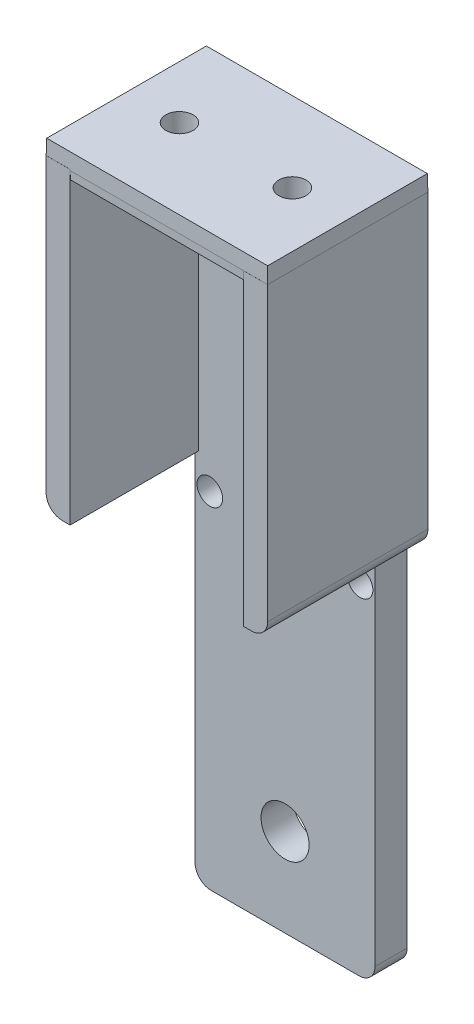
ISO-10303-21;
HEADER;
FILE_DESCRIPTION(('STEP AP214'),'2;1');
FILE_NAME('part.step','',(''),(''),'','','');
FILE_SCHEMA(('AUTOMOTIVE_DESIGN { 1 0 10303 214 1 1 1 1 }'));
ENDSEC;
DATA;
#1=APPLICATION_CONTEXT('core data for automotive mechanical design processes');
#2=APPLICATION_PROTOCOL_DEFINITION('international standard','automotive_design',2000,#1);
#3=PRODUCT_CONTEXT('',#1,'mechanical');
#4=PRODUCT('Part','Part','',(#3));
#5=PRODUCT_RELATED_PRODUCT_CATEGORY('part','',(#4));
#6=PRODUCT_DEFINITION_FORMATION('','',#4);
#7=PRODUCT_DEFINITION_CONTEXT('part definition',#1,'design');
#8=PRODUCT_DEFINITION('design','',#6,#7);
#9=PRODUCT_DEFINITION_SHAPE('','',#8);
#10=(LENGTH_UNIT() NAMED_UNIT(*) SI_UNIT(.MILLI.,.METRE.));
#11=(NAMED_UNIT(*) PLANE_ANGLE_UNIT() SI_UNIT($,.RADIAN.));
#12=(NAMED_UNIT(*) SI_UNIT($,.STERADIAN.) SOLID_ANGLE_UNIT());
#13=UNCERTAINTY_MEASURE_WITH_UNIT(LENGTH_MEASURE(1.E-05),#10,'distance_accuracy_value','');
#14=(GEOMETRIC_REPRESENTATION_CONTEXT(3) GLOBAL_UNCERTAINTY_ASSIGNED_CONTEXT((#13)) GLOBAL_UNIT_ASSIGNED_CONTEXT((#10,
#11,#12)) REPRESENTATION_CONTEXT('',''));
#15=CARTESIAN_POINT('',(0.,0.,0.));
#16=DIRECTION('',(0.,0.,1.));
#17=DIRECTION('',(1.,0.,0.));
#18=AXIS2_PLACEMENT_3D('',#15,#16,#17);
#19=CARTESIAN_POINT('',(-11.225,42.5,4.));
#20=DIRECTION('',(0.,1.,0.));
#21=DIRECTION('',(0.,0.,1.));
#22=AXIS2_PLACEMENT_3D('',#19,#20,#21);
#23=PLANE('',#22);
#24=DIRECTION('',(0.,0.,-1.));
#25=VECTOR('',#24,1.);
#26=CARTESIAN_POINT('',(13.8256157059448,42.5,20.));
#27=LINE('',#26,#25);
#28=CARTESIAN_POINT('',(13.8256157059448,42.5,20.));
#29=VERTEX_POINT('',#28);
#30=CARTESIAN_POINT('',(13.8256157059448,42.5,19.9955107536195));
#31=VERTEX_POINT('',#30);
#32=EDGE_CURVE('E301',#29,#31,#27,.T.);
#33=ORIENTED_EDGE('',*,*,#32,.T.);
#34=DIRECTION('',(1.,0.,0.));
#35=VECTOR('',#34,1.);
#36=CARTESIAN_POINT('',(13.8256157059448,42.5,19.9955107536195));
#37=LINE('',#36,#35);
#38=CARTESIAN_POINT('',(10.8256157059448,42.5,19.9955107536195));
#39=VERTEX_POINT('',#38);
#40=EDGE_CURVE('E217',#39,#31,#37,.T.);
#41=ORIENTED_EDGE('',*,*,#40,.F.);
#42=DIRECTION('',(0.,0.,-1.));
#43=VECTOR('',#42,1.);
#44=CARTESIAN_POINT('',(10.8256157059448,42.5,20.));
#45=LINE('',#44,#43);
#46=CARTESIAN_POINT('',(10.8256157059448,42.5,20.));
#47=VERTEX_POINT('',#46);
#48=EDGE_CURVE('E296',#47,#39,#45,.T.);
#49=ORIENTED_EDGE('',*,*,#48,.F.);
#50=DIRECTION('',(-1.,0.,0.));
#51=VECTOR('',#50,1.);
#52=CARTESIAN_POINT('',(10.8256157059448,42.5,20.));
#53=LINE('',#52,#51);
#54=EDGE_CURVE('E294',#29,#47,#53,.T.);
#55=ORIENTED_EDGE('',*,*,#54,.F.);
#56=EDGE_LOOP('',(#33,#41,#49,#55));
#57=FACE_BOUND('',#56,.T.);
#58=ADVANCED_FACE('F32',(#57),#23,.T.);
#59=CARTESIAN_POINT('',(-10.8172628171987,42.6265745661962,20.));
#60=DIRECTION('',(-1.,0.,0.));
#61=DIRECTION('',(0.,-1.,0.));
#62=AXIS2_PLACEMENT_3D('',#59,#60,#61);
#63=PLANE('',#62);
#64=DIRECTION('',(0.,-0.999847695156391,-0.0174524064372835));
#65=VECTOR('',#64,1.);
#66=CARTESIAN_POINT('',(-10.8172628171987,42.9755309803184,0.00830042413683257));
#67=LINE('',#66,#65);
#68=CARTESIAN_POINT('',(-10.8172628171987,42.5,0.));
#69=VERTEX_POINT('',#68);
#70=CARTESIAN_POINT('',(-10.8172628171987,42.6265745661962,0.00220936727121299));
#71=VERTEX_POINT('',#70);
#72=EDGE_CURVE('E239',#69,#71,#67,.F.);
#73=ORIENTED_EDGE('',*,*,#72,.F.);
#74=DIRECTION('',(0.,1.,0.));
#75=VECTOR('',#74,1.);
#76=CARTESIAN_POINT('',(-10.8172628171987,42.6265745661962,0.));
#77=LINE('',#76,#75);
#78=CARTESIAN_POINT('',(-10.8172628171987,42.6265745661962,0.));
#79=VERTEX_POINT('',#78);
#80=EDGE_CURVE('E263',#69,#79,#77,.T.);
#81=ORIENTED_EDGE('',*,*,#80,.T.);
#82=DIRECTION('',(0.,0.,-1.));
#83=VECTOR('',#82,1.);
#84=CARTESIAN_POINT('',(-10.8172628171987,42.6265745661962,20.));
#85=LINE('',#84,#83);
#86=EDGE_CURVE('E269',#71,#79,#85,.T.);
#87=ORIENTED_EDGE('',*,*,#86,.F.);
#88=EDGE_LOOP('',(#73,#81,#87));
#89=FACE_BOUND('',#88,.T.);
#90=ADVANCED_FACE('F422',(#89),#63,.F.);
#91=CARTESIAN_POINT('',(-13.8172628171987,42.6265745661962,20.));
#92=DIRECTION('',(0.,-1.,0.));
#93=DIRECTION('',(0.,0.,-1.));
#94=AXIS2_PLACEMENT_3D('',#91,#92,#93);
#95=PLANE('',#94);
#96=DIRECTION('',(1.,0.,0.));
#97=VECTOR('',#96,1.);
#98=CARTESIAN_POINT('',(-13.8172628171987,42.6265745661962,0.00220936727121299));
#99=LINE('',#98,#97);
#100=CARTESIAN_POINT('',(-13.8150534499275,42.6265745661962,0.0022093672712164));
#101=VERTEX_POINT('',#100);
#102=EDGE_CURVE('E41',#71,#101,#99,.F.);
#103=ORIENTED_EDGE('',*,*,#102,.F.);
#104=ORIENTED_EDGE('',*,*,#86,.T.);
#105=DIRECTION('',(-1.,0.,0.));
#106=VECTOR('',#105,1.);
#107=CARTESIAN_POINT('',(-13.8172628171987,42.6265745661962,0.));
#108=LINE('',#107,#106);
#109=CARTESIAN_POINT('',(-13.8172628171987,42.6265745661962,0.));
#110=VERTEX_POINT('',#109);
#111=EDGE_CURVE('E253',#79,#110,#108,.T.);
#112=ORIENTED_EDGE('',*,*,#111,.T.);
#113=DIRECTION('',(0.,0.,-1.));
#114=VECTOR('',#113,1.);
#115=CARTESIAN_POINT('',(-13.8172628171987,42.6265745661962,20.));
#116=LINE('',#115,#114);
#117=CARTESIAN_POINT('',(-13.8172628171987,42.6265745661962,20.));
#118=VERTEX_POINT('',#117);
#119=EDGE_CURVE('E259',#118,#110,#116,.T.);
#120=ORIENTED_EDGE('',*,*,#119,.F.);
#121=DIRECTION('',(-1.,0.,0.));
#122=VECTOR('',#121,1.);
#123=CARTESIAN_POINT('',(-13.8172628171987,42.6265745661962,20.));
#124=LINE('',#123,#122);
#125=CARTESIAN_POINT('',(-10.8172628171987,42.6265745661962,20.));
#126=VERTEX_POINT('',#125);
#127=EDGE_CURVE('E257',#126,#118,#124,.T.);
#128=ORIENTED_EDGE('',*,*,#127,.F.);
#129=CARTESIAN_POINT('',(-10.8172628171987,42.6265745661962,19.9933013863483));
#130=VERTEX_POINT('',#129);
#131=EDGE_CURVE('E270',#126,#130,#85,.T.);
#132=ORIENTED_EDGE('',*,*,#131,.T.);
#133=DIRECTION('',(-1.,0.,0.));
#134=VECTOR('',#133,1.);
#135=CARTESIAN_POINT('',(-13.8172628171987,42.6265745661962,19.9933013863483));
#136=LINE('',#135,#134);
#137=CARTESIAN_POINT('',(-13.8150534499275,42.6265745661962,19.9933013863483));
#138=VERTEX_POINT('',#137);
#139=EDGE_CURVE('E390',#138,#130,#136,.F.);
#140=ORIENTED_EDGE('',*,*,#139,.F.);
#141=DIRECTION('',(0.,0.,-1.));
#142=VECTOR('',#141,1.);
#143=CARTESIAN_POINT('',(-13.8150534499275,42.6265745661962,20.));
#144=LINE('',#143,#142);
#145=EDGE_CURVE('E393',#101,#138,#144,.F.);
#146=ORIENTED_EDGE('',*,*,#145,.F.);
#147=EDGE_LOOP('',(#103,#104,#112,#120,#128,#132,#140,#146));
#148=FACE_BOUND('',#147,.T.);
#149=ADVANCED_FACE('F429',(#148),#95,.F.);
#150=CARTESIAN_POINT('',(0.,0.,4.));
#151=DIRECTION('',(0.,0.,-1.));
#152=DIRECTION('',(-1.,0.,0.));
#153=AXIS2_PLACEMENT_3D('',#150,#151,#152);
#154=PLANE('',#153);
#155=CARTESIAN_POINT('',(-9.39147478922262,0.549780329016245,4.));
#156=DIRECTION('',(0.,0.,1.));
#157=DIRECTION('',(1.,0.,0.));
#158=AXIS2_PLACEMENT_3D('',#155,#156,#157);
#159=CIRCLE('',#158,1.6);
#160=CARTESIAN_POINT('',(-7.79147478922262,0.549780329016245,4.));
#161=VERTEX_POINT('',#160);
#162=EDGE_CURVE('E315',#161,#161,#159,.T.);
#163=ORIENTED_EDGE('',*,*,#162,.F.);
#164=EDGE_LOOP('',(#163));
#165=FACE_BOUND('',#164,.T.);
#166=CARTESIAN_POINT('',(9.35940364880709,0.0497499299107451,4.));
#167=DIRECTION('',(0.,0.,1.));
#168=DIRECTION('',(1.,0.,0.));
#169=AXIS2_PLACEMENT_3D('',#166,#167,#168);
#170=CIRCLE('',#169,1.6);
#171=CARTESIAN_POINT('',(10.9594036488071,0.0497499299107451,4.));
#172=VERTEX_POINT('',#171);
#173=EDGE_CURVE('E322',#172,#172,#170,.T.);
#174=ORIENTED_EDGE('',*,*,#173,.F.);
#175=EDGE_LOOP('',(#174));
#176=FACE_BOUND('',#175,.T.);
#177=CARTESIAN_POINT('',(0.,-31.5,4.));
#178=DIRECTION('',(0.,0.,1.));
#179=DIRECTION('',(1.,0.,0.));
#180=AXIS2_PLACEMENT_3D('',#177,#178,#179);
#181=CIRCLE('',#180,3.);
#182=CARTESIAN_POINT('',(3.,-31.5,4.));
#183=VERTEX_POINT('',#182);
#184=EDGE_CURVE('E327',#183,#183,#181,.T.);
#185=ORIENTED_EDGE('',*,*,#184,.F.);
#186=EDGE_LOOP('',(#185));
#187=FACE_BOUND('',#186,.T.);
#188=DIRECTION('',(0.,-1.,0.));
#189=VECTOR('',#188,1.);
#190=CARTESIAN_POINT('',(10.8256157059448,0.,4.));
#191=LINE('',#190,#189);
#192=CARTESIAN_POINT('',(10.8256157059448,41.5,4.));
#193=VERTEX_POINT('',#192);
#194=CARTESIAN_POINT('',(10.8256157059448,4.06249585883763,4.));
#195=VERTEX_POINT('',#194);
#196=EDGE_CURVE('E312',#193,#195,#191,.T.);
#197=ORIENTED_EDGE('',*,*,#196,.F.);
#198=DIRECTION('',(-1.,0.,0.));
#199=VECTOR('',#198,1.);
#200=CARTESIAN_POINT('',(0.,41.5,4.));
#201=LINE('',#200,#199);
#202=CARTESIAN_POINT('',(-10.8172628171987,41.5,4.));
#203=VERTEX_POINT('',#202);
#204=EDGE_CURVE('E245',#193,#203,#201,.T.);
#205=ORIENTED_EDGE('',*,*,#204,.T.);
#206=DIRECTION('',(0.,1.,0.));
#207=VECTOR('',#206,1.);
#208=CARTESIAN_POINT('',(-10.8172628171987,0.,4.));
#209=LINE('',#208,#207);
#210=CARTESIAN_POINT('',(-10.8172628171987,4.18907042503389,4.));
#211=VERTEX_POINT('',#210);
#212=EDGE_CURVE('E275',#211,#203,#209,.T.);
#213=ORIENTED_EDGE('',*,*,#212,.F.);
#214=DIRECTION('',(1.,0.,0.));
#215=VECTOR('',#214,1.);
#216=CARTESIAN_POINT('',(0.,4.18907042503389,4.));
#217=LINE('',#216,#215);
#218=CARTESIAN_POINT('',(-11.225,4.18907042503389,4.));
#219=VERTEX_POINT('',#218);
#220=EDGE_CURVE('E281',#219,#211,#217,.T.);
#221=ORIENTED_EDGE('',*,*,#220,.F.);
#222=DIRECTION('',(0.,-1.,0.));
#223=VECTOR('',#222,1.);
#224=CARTESIAN_POINT('',(-11.225,42.5,4.));
#225=LINE('',#224,#223);
#226=CARTESIAN_POINT('',(-11.225,-40.5,4.));
#227=VERTEX_POINT('',#226);
#228=EDGE_CURVE('E340',#219,#227,#225,.T.);
#229=ORIENTED_EDGE('',*,*,#228,.T.);
#230=CARTESIAN_POINT('',(-9.225,-40.5,4.));
#231=DIRECTION('',(0.,0.,-1.));
#232=DIRECTION('',(-1.,0.,0.));
#233=AXIS2_PLACEMENT_3D('',#230,#231,#232);
#234=CIRCLE('',#233,2.);
#235=CARTESIAN_POINT('',(-9.225,-42.5,4.));
#236=VERTEX_POINT('',#235);
#237=EDGE_CURVE('E384',#227,#236,#234,.F.);
#238=ORIENTED_EDGE('',*,*,#237,.T.);
#239=DIRECTION('',(1.,0.,0.));
#240=VECTOR('',#239,1.);
#241=CARTESIAN_POINT('',(-11.225,-42.5,4.));
#242=LINE('',#241,#240);
#243=CARTESIAN_POINT('',(9.225,-42.5,4.));
#244=VERTEX_POINT('',#243);
#245=EDGE_CURVE('E333',#236,#244,#242,.T.);
#246=ORIENTED_EDGE('',*,*,#245,.T.);
#247=CARTESIAN_POINT('',(9.225,-40.5,4.));
#248=DIRECTION('',(0.,0.,-1.));
#249=DIRECTION('',(-1.,0.,0.));
#250=AXIS2_PLACEMENT_3D('',#247,#248,#249);
#251=CIRCLE('',#250,2.);
#252=CARTESIAN_POINT('',(11.225,-40.5,4.));
#253=VERTEX_POINT('',#252);
#254=EDGE_CURVE('E386',#244,#253,#251,.F.);
#255=ORIENTED_EDGE('',*,*,#254,.T.);
#256=DIRECTION('',(0.,-1.,0.));
#257=VECTOR('',#256,1.);
#258=CARTESIAN_POINT('',(11.225,42.5,4.));
#259=LINE('',#258,#257);
#260=CARTESIAN_POINT('',(11.225,4.06249585883763,4.));
#261=VERTEX_POINT('',#260);
#262=EDGE_CURVE('E336',#261,#253,#259,.T.);
#263=ORIENTED_EDGE('',*,*,#262,.F.);
#264=DIRECTION('',(1.,0.,0.));
#265=VECTOR('',#264,1.);
#266=CARTESIAN_POINT('',(0.,4.06249585883763,4.));
#267=LINE('',#266,#265);
#268=EDGE_CURVE('E307',#195,#261,#267,.T.);
#269=ORIENTED_EDGE('',*,*,#268,.F.);
#270=EDGE_LOOP('',(#197,#205,#213,#221,#229,#238,#246,#255,#263,#269));
#271=FACE_BOUND('',#270,.T.);
#272=ADVANCED_FACE('F466',(#165,#176,#187,#271),#154,.F.);
#273=CARTESIAN_POINT('',(-11.225,42.5,4.));
#274=DIRECTION('',(1.,0.,0.));
#275=DIRECTION('',(0.,1.,0.));
#276=AXIS2_PLACEMENT_3D('',#273,#274,#275);
#277=PLANE('',#276);
#278=DIRECTION('',(0.,-1.,0.));
#279=VECTOR('',#278,1.);
#280=CARTESIAN_POINT('',(-11.225,42.5,0.));
#281=LINE('',#280,#279);
#282=CARTESIAN_POINT('',(-11.225,4.18907042503389,0.));
#283=VERTEX_POINT('',#282);
#284=CARTESIAN_POINT('',(-11.225,-40.5,0.));
#285=VERTEX_POINT('',#284);
#286=EDGE_CURVE('E337',#283,#285,#281,.T.);
#287=ORIENTED_EDGE('',*,*,#286,.T.);
#288=DIRECTION('',(0.,0.,-1.));
#289=VECTOR('',#288,1.);
#290=CARTESIAN_POINT('',(-11.225,-40.5,4.));
#291=LINE('',#290,#289);
#292=EDGE_CURVE('E388',#285,#227,#291,.F.);
#293=ORIENTED_EDGE('',*,*,#292,.T.);
#294=ORIENTED_EDGE('',*,*,#228,.F.);
#295=DIRECTION('',(0.,0.,1.));
#296=VECTOR('',#295,1.);
#297=CARTESIAN_POINT('',(-11.225,4.18907042503389,4.));
#298=LINE('',#297,#296);
#299=EDGE_CURVE('E278',#283,#219,#298,.T.);
#300=ORIENTED_EDGE('',*,*,#299,.F.);
#301=EDGE_LOOP('',(#287,#293,#294,#300));
#302=FACE_BOUND('',#301,.T.);
#303=ADVANCED_FACE('F435',(#302),#277,.F.);
#304=CARTESIAN_POINT('',(11.225,42.5,4.));
#305=DIRECTION('',(1.,0.,0.));
#306=DIRECTION('',(0.,1.,0.));
#307=AXIS2_PLACEMENT_3D('',#304,#305,#306);
#308=PLANE('',#307);
#309=ORIENTED_EDGE('',*,*,#262,.T.);
#310=DIRECTION('',(0.,0.,-1.));
#311=VECTOR('',#310,1.);
#312=CARTESIAN_POINT('',(11.225,-40.5,0.));
#313=LINE('',#312,#311);
#314=CARTESIAN_POINT('',(11.225,-40.5,0.));
#315=VERTEX_POINT('',#314);
#316=EDGE_CURVE('E376',#253,#315,#313,.T.);
#317=ORIENTED_EDGE('',*,*,#316,.T.);
#318=DIRECTION('',(0.,-1.,0.));
#319=VECTOR('',#318,1.);
#320=CARTESIAN_POINT('',(11.225,42.5,0.));
#321=LINE('',#320,#319);
#322=CARTESIAN_POINT('',(11.225,4.06249585883763,0.));
#323=VERTEX_POINT('',#322);
#324=EDGE_CURVE('E346',#323,#315,#321,.T.);
#325=ORIENTED_EDGE('',*,*,#324,.F.);
#326=DIRECTION('',(0.,0.,1.));
#327=VECTOR('',#326,1.);
#328=CARTESIAN_POINT('',(11.225,4.06249585883763,4.));
#329=LINE('',#328,#327);
#330=EDGE_CURVE('E309',#323,#261,#329,.T.);
#331=ORIENTED_EDGE('',*,*,#330,.T.);
#332=EDGE_LOOP('',(#309,#317,#325,#331));
#333=FACE_BOUND('',#332,.T.);
#334=ADVANCED_FACE('F437',(#333),#308,.T.);
#335=CARTESIAN_POINT('',(-11.225,-42.5,4.));
#336=DIRECTION('',(0.,1.,0.));
#337=DIRECTION('',(0.,0.,1.));
#338=AXIS2_PLACEMENT_3D('',#335,#336,#337);
#339=PLANE('',#338);
#340=DIRECTION('',(1.,0.,0.));
#341=VECTOR('',#340,1.);
#342=CARTESIAN_POINT('',(-11.225,-42.5,0.));
#343=LINE('',#342,#341);
#344=CARTESIAN_POINT('',(-9.225,-42.5,0.));
#345=VERTEX_POINT('',#344);
#346=CARTESIAN_POINT('',(9.225,-42.5,0.));
#347=VERTEX_POINT('',#346);
#348=EDGE_CURVE('E330',#345,#347,#343,.T.);
#349=ORIENTED_EDGE('',*,*,#348,.T.);
#350=DIRECTION('',(0.,0.,-1.));
#351=VECTOR('',#350,1.);
#352=CARTESIAN_POINT('',(9.225,-42.5,4.));
#353=LINE('',#352,#351);
#354=EDGE_CURVE('E382',#347,#244,#353,.F.);
#355=ORIENTED_EDGE('',*,*,#354,.T.);
#356=ORIENTED_EDGE('',*,*,#245,.F.);
#357=DIRECTION('',(0.,0.,-1.));
#358=VECTOR('',#357,1.);
#359=CARTESIAN_POINT('',(-9.225,-42.5,4.));
#360=LINE('',#359,#358);
#361=EDGE_CURVE('E379',#236,#345,#360,.T.);
#362=ORIENTED_EDGE('',*,*,#361,.T.);
#363=EDGE_LOOP('',(#349,#355,#356,#362));
#364=FACE_BOUND('',#363,.T.);
#365=ADVANCED_FACE('F440',(#364),#339,.F.);
#366=CARTESIAN_POINT('',(0.,0.,0.));
#367=DIRECTION('',(0.,0.,-1.));
#368=DIRECTION('',(-1.,0.,0.));
#369=AXIS2_PLACEMENT_3D('',#366,#367,#368);
#370=PLANE('',#369);
#371=CARTESIAN_POINT('',(-11.8172628171987,6.18907042503389,0.));
#372=DIRECTION('',(0.,0.,-1.));
#373=DIRECTION('',(-1.,0.,0.));
#374=AXIS2_PLACEMENT_3D('',#371,#372,#373);
#375=CIRCLE('',#374,2.);
#376=CARTESIAN_POINT('',(-11.8172628171987,4.18907042503389,0.));
#377=VERTEX_POINT('',#376);
#378=CARTESIAN_POINT('',(-13.8172628171987,6.18907042503389,0.));
#379=VERTEX_POINT('',#378);
#380=EDGE_CURVE('E360',#377,#379,#375,.T.);
#381=ORIENTED_EDGE('',*,*,#380,.T.);
#382=DIRECTION('',(0.,-1.,0.));
#383=VECTOR('',#382,1.);
#384=CARTESIAN_POINT('',(-13.8172628171987,42.6265745661962,0.));
#385=LINE('',#384,#383);
#386=EDGE_CURVE('E248',#110,#379,#385,.T.);
#387=ORIENTED_EDGE('',*,*,#386,.F.);
#388=ORIENTED_EDGE('',*,*,#111,.F.);
#389=ORIENTED_EDGE('',*,*,#80,.F.);
#390=DIRECTION('',(1.,0.,0.));
#391=VECTOR('',#390,1.);
#392=CARTESIAN_POINT('',(-11.225,42.5,0.));
#393=LINE('',#392,#391);
#394=CARTESIAN_POINT('',(13.8256157059448,42.5,0.));
#395=VERTEX_POINT('',#394);
#396=EDGE_CURVE('E349',#69,#395,#393,.T.);
#397=ORIENTED_EDGE('',*,*,#396,.T.);
#398=DIRECTION('',(0.,1.,0.));
#399=VECTOR('',#398,1.);
#400=CARTESIAN_POINT('',(13.8256157059448,42.5,0.));
#401=LINE('',#400,#399);
#402=CARTESIAN_POINT('',(13.8256157059448,6.06249585883763,0.));
#403=VERTEX_POINT('',#402);
#404=EDGE_CURVE('E289',#403,#395,#401,.T.);
#405=ORIENTED_EDGE('',*,*,#404,.F.);
#406=CARTESIAN_POINT('',(11.8256157059448,6.06249585883763,0.));
#407=DIRECTION('',(0.,0.,-1.));
#408=DIRECTION('',(-1.,0.,0.));
#409=AXIS2_PLACEMENT_3D('',#406,#407,#408);
#410=CIRCLE('',#409,2.);
#411=CARTESIAN_POINT('',(11.8256157059448,4.06249585883763,0.));
#412=VERTEX_POINT('',#411);
#413=EDGE_CURVE('E363',#403,#412,#410,.T.);
#414=ORIENTED_EDGE('',*,*,#413,.T.);
#415=DIRECTION('',(1.,0.,0.));
#416=VECTOR('',#415,1.);
#417=CARTESIAN_POINT('',(10.8256157059448,4.06249585883763,0.));
#418=LINE('',#417,#416);
#419=EDGE_CURVE('E284',#323,#412,#418,.T.);
#420=ORIENTED_EDGE('',*,*,#419,.F.);
#421=ORIENTED_EDGE('',*,*,#324,.T.);
#422=CARTESIAN_POINT('',(9.225,-40.5,0.));
#423=DIRECTION('',(0.,0.,-1.));
#424=DIRECTION('',(-1.,0.,0.));
#425=AXIS2_PLACEMENT_3D('',#422,#423,#424);
#426=CIRCLE('',#425,2.);
#427=EDGE_CURVE('E358',#315,#347,#426,.T.);
#428=ORIENTED_EDGE('',*,*,#427,.T.);
#429=ORIENTED_EDGE('',*,*,#348,.F.);
#430=CARTESIAN_POINT('',(-9.225,-40.5,0.));
#431=DIRECTION('',(0.,0.,-1.));
#432=DIRECTION('',(-1.,0.,0.));
#433=AXIS2_PLACEMENT_3D('',#430,#431,#432);
#434=CIRCLE('',#433,2.);
#435=EDGE_CURVE('E356',#345,#285,#434,.T.);
#436=ORIENTED_EDGE('',*,*,#435,.T.);
#437=ORIENTED_EDGE('',*,*,#286,.F.);
#438=DIRECTION('',(1.,0.,0.));
#439=VECTOR('',#438,1.);
#440=CARTESIAN_POINT('',(-13.8172628171987,4.18907042503389,0.));
#441=LINE('',#440,#439);
#442=EDGE_CURVE('E261',#377,#283,#441,.T.);
#443=ORIENTED_EDGE('',*,*,#442,.F.);
#444=EDGE_LOOP('',(#381,#387,#388,#389,#397,#405,#414,#420,#421,#428,#429,#436,#437,#443));
#445=FACE_BOUND('',#444,.T.);
#446=CARTESIAN_POINT('',(-9.39147478922262,0.549780329016245,0.));
#447=DIRECTION('',(0.,0.,1.));
#448=DIRECTION('',(1.,0.,0.));
#449=AXIS2_PLACEMENT_3D('',#446,#447,#448);
#450=CIRCLE('',#449,1.6);
#451=CARTESIAN_POINT('',(-7.79147478922262,0.549780329016245,0.));
#452=VERTEX_POINT('',#451);
#453=EDGE_CURVE('E319',#452,#452,#450,.T.);
#454=ORIENTED_EDGE('',*,*,#453,.T.);
#455=EDGE_LOOP('',(#454));
#456=FACE_BOUND('',#455,.T.);
#457=CARTESIAN_POINT('',(9.35940364880709,0.0497499299107451,0.));
#458=DIRECTION('',(0.,0.,1.));
#459=DIRECTION('',(1.,0.,0.));
#460=AXIS2_PLACEMENT_3D('',#457,#458,#459);
#461=CIRCLE('',#460,1.6);
#462=CARTESIAN_POINT('',(10.9594036488071,0.0497499299107451,0.));
#463=VERTEX_POINT('',#462);
#464=EDGE_CURVE('E314',#463,#463,#461,.T.);
#465=ORIENTED_EDGE('',*,*,#464,.T.);
#466=EDGE_LOOP('',(#465));
#467=FACE_BOUND('',#466,.T.);
#468=CARTESIAN_POINT('',(0.,-31.5,0.));
#469=DIRECTION('',(0.,0.,1.));
#470=DIRECTION('',(1.,0.,0.));
#471=AXIS2_PLACEMENT_3D('',#468,#469,#470);
#472=CIRCLE('',#471,3.);
#473=CARTESIAN_POINT('',(3.,-31.5,0.));
#474=VERTEX_POINT('',#473);
#475=EDGE_CURVE('E318',#474,#474,#472,.T.);
#476=ORIENTED_EDGE('',*,*,#475,.T.);
#477=EDGE_LOOP('',(#476));
#478=FACE_BOUND('',#477,.T.);
#479=ADVANCED_FACE('F444',(#445,#456,#467,#478),#370,.T.);
#480=CARTESIAN_POINT('',(0.,-31.5,4.));
#481=DIRECTION('',(0.,0.,-1.));
#482=DIRECTION('',(-1.,0.,0.));
#483=AXIS2_PLACEMENT_3D('',#480,#481,#482);
#484=CYLINDRICAL_SURFACE('',#483,3.);
#485=ORIENTED_EDGE('',*,*,#184,.T.);
#486=EDGE_LOOP('',(#485));
#487=FACE_BOUND('',#486,.T.);
#488=ORIENTED_EDGE('',*,*,#475,.F.);
#489=EDGE_LOOP('',(#488));
#490=FACE_BOUND('',#489,.T.);
#491=ADVANCED_FACE('F573',(#487,#490),#484,.F.);
#492=CARTESIAN_POINT('',(9.35940364880709,0.0497499299107451,4.));
#493=DIRECTION('',(0.,0.,-1.));
#494=DIRECTION('',(-1.,0.,0.));
#495=AXIS2_PLACEMENT_3D('',#492,#493,#494);
#496=CYLINDRICAL_SURFACE('',#495,1.6);
#497=ORIENTED_EDGE('',*,*,#173,.T.);
#498=EDGE_LOOP('',(#497));
#499=FACE_BOUND('',#498,.T.);
#500=ORIENTED_EDGE('',*,*,#464,.F.);
#501=EDGE_LOOP('',(#500));
#502=FACE_BOUND('',#501,.T.);
#503=ADVANCED_FACE('F569',(#499,#502),#496,.F.);
#504=CARTESIAN_POINT('',(-9.39147478922262,0.549780329016245,4.));
#505=DIRECTION('',(0.,0.,-1.));
#506=DIRECTION('',(-1.,0.,0.));
#507=AXIS2_PLACEMENT_3D('',#504,#505,#506);
#508=CYLINDRICAL_SURFACE('',#507,1.6);
#509=ORIENTED_EDGE('',*,*,#162,.T.);
#510=EDGE_LOOP('',(#509));
#511=FACE_BOUND('',#510,.T.);
#512=ORIENTED_EDGE('',*,*,#453,.F.);
#513=EDGE_LOOP('',(#512));
#514=FACE_BOUND('',#513,.T.);
#515=ADVANCED_FACE('F566',(#511,#514),#508,.F.);
#516=CARTESIAN_POINT('',(10.8256157059448,42.5,20.));
#517=DIRECTION('',(1.,0.,0.));
#518=DIRECTION('',(0.,1.,0.));
#519=AXIS2_PLACEMENT_3D('',#516,#517,#518);
#520=PLANE('',#519);
#521=ORIENTED_EDGE('',*,*,#48,.T.);
#522=DIRECTION('',(0.,-0.999847695156391,-0.0174524064372835));
#523=VECTOR('',#522,1.);
#524=CARTESIAN_POINT('',(10.8256157059448,42.5000783362196,19.9955121209833));
#525=LINE('',#524,#523);
#526=CARTESIAN_POINT('',(10.8256157059448,41.5,19.9780556886913));
#527=VERTEX_POINT('',#526);
#528=EDGE_CURVE('E49',#39,#527,#525,.T.);
#529=ORIENTED_EDGE('',*,*,#528,.T.);
#530=DIRECTION('',(0.,0.,-1.));
#531=VECTOR('',#530,1.);
#532=CARTESIAN_POINT('',(10.8256157059448,41.5,20.));
#533=LINE('',#532,#531);
#534=EDGE_CURVE('E53',#527,#193,#533,.T.);
#535=ORIENTED_EDGE('',*,*,#534,.T.);
#536=ORIENTED_EDGE('',*,*,#196,.T.);
#537=DIRECTION('',(0.,0.,-1.));
#538=VECTOR('',#537,1.);
#539=CARTESIAN_POINT('',(10.8256157059448,4.06249585883763,20.));
#540=LINE('',#539,#538);
#541=CARTESIAN_POINT('',(10.8256157059448,4.06249585883763,20.));
#542=VERTEX_POINT('',#541);
#543=EDGE_CURVE('E304',#542,#195,#540,.T.);
#544=ORIENTED_EDGE('',*,*,#543,.F.);
#545=DIRECTION('',(0.,-1.,0.));
#546=VECTOR('',#545,1.);
#547=CARTESIAN_POINT('',(10.8256157059448,42.5,20.));
#548=LINE('',#547,#546);
#549=EDGE_CURVE('E285',#47,#542,#548,.T.);
#550=ORIENTED_EDGE('',*,*,#549,.F.);
#551=EDGE_LOOP('',(#521,#529,#535,#536,#544,#550));
#552=FACE_BOUND('',#551,.T.);
#553=ADVANCED_FACE('F563',(#552),#520,.F.);
#554=CARTESIAN_POINT('',(10.8256157059448,4.06249585883763,20.));
#555=DIRECTION('',(0.,1.,0.));
#556=DIRECTION('',(0.,0.,1.));
#557=AXIS2_PLACEMENT_3D('',#554,#555,#556);
#558=PLANE('',#557);
#559=ORIENTED_EDGE('',*,*,#419,.T.);
#560=DIRECTION('',(0.,0.,-1.));
#561=VECTOR('',#560,1.);
#562=CARTESIAN_POINT('',(11.8256157059448,4.06249585883763,20.));
#563=LINE('',#562,#561);
#564=CARTESIAN_POINT('',(11.8256157059448,4.06249585883763,20.));
#565=VERTEX_POINT('',#564);
#566=EDGE_CURVE('E365',#412,#565,#563,.F.);
#567=ORIENTED_EDGE('',*,*,#566,.T.);
#568=DIRECTION('',(1.,0.,0.));
#569=VECTOR('',#568,1.);
#570=CARTESIAN_POINT('',(10.8256157059448,4.06249585883763,20.));
#571=LINE('',#570,#569);
#572=EDGE_CURVE('E288',#542,#565,#571,.T.);
#573=ORIENTED_EDGE('',*,*,#572,.F.);
#574=ORIENTED_EDGE('',*,*,#543,.T.);
#575=ORIENTED_EDGE('',*,*,#268,.T.);
#576=ORIENTED_EDGE('',*,*,#330,.F.);
#577=EDGE_LOOP('',(#559,#567,#573,#574,#575,#576));
#578=FACE_BOUND('',#577,.T.);
#579=ADVANCED_FACE('F472',(#578),#558,.F.);
#580=CARTESIAN_POINT('',(13.8256157059448,42.5,20.));
#581=DIRECTION('',(-1.,0.,0.));
#582=DIRECTION('',(0.,-1.,0.));
#583=AXIS2_PLACEMENT_3D('',#580,#581,#582);
#584=PLANE('',#583);
#585=DIRECTION('',(0.,1.,0.));
#586=VECTOR('',#585,1.);
#587=CARTESIAN_POINT('',(13.8256157059448,42.5,20.));
#588=LINE('',#587,#586);
#589=CARTESIAN_POINT('',(13.8256157059448,6.06249585883763,20.));
#590=VERTEX_POINT('',#589);
#591=EDGE_CURVE('E292',#590,#29,#588,.T.);
#592=ORIENTED_EDGE('',*,*,#591,.F.);
#593=DIRECTION('',(0.,0.,-1.));
#594=VECTOR('',#593,1.);
#595=CARTESIAN_POINT('',(13.8256157059448,6.06249585883763,20.));
#596=LINE('',#595,#594);
#597=EDGE_CURVE('E343',#590,#403,#596,.T.);
#598=ORIENTED_EDGE('',*,*,#597,.T.);
#599=ORIENTED_EDGE('',*,*,#404,.T.);
#600=DIRECTION('',(0.,0.,-1.));
#601=VECTOR('',#600,1.);
#602=CARTESIAN_POINT('',(13.8256157059448,42.5,0.));
#603=LINE('',#602,#601);
#604=EDGE_CURVE('E215',#31,#395,#603,.T.);
#605=ORIENTED_EDGE('',*,*,#604,.F.);
#606=ORIENTED_EDGE('',*,*,#32,.F.);
#607=EDGE_LOOP('',(#592,#598,#599,#605,#606));
#608=FACE_BOUND('',#607,.T.);
#609=ADVANCED_FACE('F481',(#608),#584,.F.);
#610=CARTESIAN_POINT('',(0.,0.,20.));
#611=DIRECTION('',(0.,0.,1.));
#612=DIRECTION('',(1.,0.,0.));
#613=AXIS2_PLACEMENT_3D('',#610,#611,#612);
#614=PLANE('',#613);
#615=ORIENTED_EDGE('',*,*,#572,.T.);
#616=CARTESIAN_POINT('',(11.8256157059448,6.06249585883763,20.));
#617=DIRECTION('',(0.,0.,1.));
#618=DIRECTION('',(1.,0.,0.));
#619=AXIS2_PLACEMENT_3D('',#616,#617,#618);
#620=CIRCLE('',#619,2.);
#621=EDGE_CURVE('E367',#565,#590,#620,.T.);
#622=ORIENTED_EDGE('',*,*,#621,.T.);
#623=ORIENTED_EDGE('',*,*,#591,.T.);
#624=ORIENTED_EDGE('',*,*,#54,.T.);
#625=ORIENTED_EDGE('',*,*,#549,.T.);
#626=EDGE_LOOP('',(#615,#622,#623,#624,#625));
#627=FACE_BOUND('',#626,.T.);
#628=ADVANCED_FACE('F485',(#627),#614,.T.);
#629=CARTESIAN_POINT('',(-13.8172628171987,4.18907042503389,20.));
#630=DIRECTION('',(0.,1.,0.));
#631=DIRECTION('',(0.,0.,1.));
#632=AXIS2_PLACEMENT_3D('',#629,#630,#631);
#633=PLANE('',#632);
#634=DIRECTION('',(1.,0.,0.));
#635=VECTOR('',#634,1.);
#636=CARTESIAN_POINT('',(-13.8172628171987,4.18907042503389,20.));
#637=LINE('',#636,#635);
#638=CARTESIAN_POINT('',(-11.8172628171987,4.18907042503389,20.));
#639=VERTEX_POINT('',#638);
#640=CARTESIAN_POINT('',(-10.8172628171987,4.18907042503389,20.));
#641=VERTEX_POINT('',#640);
#642=EDGE_CURVE('E252',#639,#641,#637,.T.);
#643=ORIENTED_EDGE('',*,*,#642,.F.);
#644=DIRECTION('',(0.,0.,-1.));
#645=VECTOR('',#644,1.);
#646=CARTESIAN_POINT('',(-11.8172628171987,4.18907042503389,20.));
#647=LINE('',#646,#645);
#648=EDGE_CURVE('E369',#639,#377,#647,.T.);
#649=ORIENTED_EDGE('',*,*,#648,.T.);
#650=ORIENTED_EDGE('',*,*,#442,.T.);
#651=ORIENTED_EDGE('',*,*,#299,.T.);
#652=ORIENTED_EDGE('',*,*,#220,.T.);
#653=DIRECTION('',(0.,0.,-1.));
#654=VECTOR('',#653,1.);
#655=CARTESIAN_POINT('',(-10.8172628171987,4.18907042503389,20.));
#656=LINE('',#655,#654);
#657=EDGE_CURVE('E272',#641,#211,#656,.T.);
#658=ORIENTED_EDGE('',*,*,#657,.F.);
#659=EDGE_LOOP('',(#643,#649,#650,#651,#652,#658));
#660=FACE_BOUND('',#659,.T.);
#661=ADVANCED_FACE('F514',(#660),#633,.F.);
#662=ORIENTED_EDGE('',*,*,#212,.T.);
#663=DIRECTION('',(0.,0.,1.));
#664=VECTOR('',#663,1.);
#665=CARTESIAN_POINT('',(-10.8172628171987,41.5,20.));
#666=LINE('',#665,#664);
#667=CARTESIAN_POINT('',(-10.8172628171987,41.5,19.9780556886913));
#668=VERTEX_POINT('',#667);
#669=EDGE_CURVE('E11',#203,#668,#666,.T.);
#670=ORIENTED_EDGE('',*,*,#669,.T.);
#671=DIRECTION('',(0.,0.999847695156391,0.0174524064372835));
#672=VECTOR('',#671,1.);
#673=CARTESIAN_POINT('',(-10.8172628171987,42.626614349513,19.9977208153111));
#674=LINE('',#673,#672);
#675=CARTESIAN_POINT('',(-10.8172628171987,42.5,19.9955107536195));
#676=VERTEX_POINT('',#675);
#677=EDGE_CURVE('E242',#668,#676,#674,.T.);
#678=ORIENTED_EDGE('',*,*,#677,.T.);
#679=DIRECTION('',(0.,0.999847695156391,-0.0174524064372835));
#680=VECTOR('',#679,1.);
#681=CARTESIAN_POINT('',(-10.8172628171987,42.6264576770737,19.9933034266555));
#682=LINE('',#681,#680);
#683=EDGE_CURVE('E236',#130,#676,#682,.F.);
#684=ORIENTED_EDGE('',*,*,#683,.F.);
#685=ORIENTED_EDGE('',*,*,#131,.F.);
#686=DIRECTION('',(0.,1.,0.));
#687=VECTOR('',#686,1.);
#688=CARTESIAN_POINT('',(-10.8172628171987,42.6265745661962,20.));
#689=LINE('',#688,#687);
#690=EDGE_CURVE('E255',#641,#126,#689,.T.);
#691=ORIENTED_EDGE('',*,*,#690,.F.);
#692=ORIENTED_EDGE('',*,*,#657,.T.);
#693=EDGE_LOOP('',(#662,#670,#678,#684,#685,#691,#692));
#694=FACE_BOUND('',#693,.T.);
#695=ADVANCED_FACE('F432',(#694),#63,.F.);
#696=CARTESIAN_POINT('',(-13.8172628171987,42.6265745661962,20.));
#697=DIRECTION('',(1.,0.,0.));
#698=DIRECTION('',(0.,1.,0.));
#699=AXIS2_PLACEMENT_3D('',#696,#697,#698);
#700=PLANE('',#699);
#701=ORIENTED_EDGE('',*,*,#386,.T.);
#702=DIRECTION('',(0.,0.,-1.));
#703=VECTOR('',#702,1.);
#704=CARTESIAN_POINT('',(-13.8172628171987,6.18907042503389,20.));
#705=LINE('',#704,#703);
#706=CARTESIAN_POINT('',(-13.8172628171987,6.18907042503389,20.));
#707=VERTEX_POINT('',#706);
#708=EDGE_CURVE('E372',#379,#707,#705,.F.);
#709=ORIENTED_EDGE('',*,*,#708,.T.);
#710=DIRECTION('',(0.,-1.,0.));
#711=VECTOR('',#710,1.);
#712=CARTESIAN_POINT('',(-13.8172628171987,42.6265745661962,20.));
#713=LINE('',#712,#711);
#714=EDGE_CURVE('E249',#118,#707,#713,.T.);
#715=ORIENTED_EDGE('',*,*,#714,.F.);
#716=ORIENTED_EDGE('',*,*,#119,.T.);
#717=EDGE_LOOP('',(#701,#709,#715,#716));
#718=FACE_BOUND('',#717,.T.);
#719=ADVANCED_FACE('F527',(#718),#700,.F.);
#720=CARTESIAN_POINT('',(0.,0.,20.));
#721=DIRECTION('',(0.,0.,1.));
#722=DIRECTION('',(1.,0.,0.));
#723=AXIS2_PLACEMENT_3D('',#720,#721,#722);
#724=PLANE('',#723);
#725=ORIENTED_EDGE('',*,*,#714,.T.);
#726=CARTESIAN_POINT('',(-11.8172628171987,6.18907042503389,20.));
#727=DIRECTION('',(0.,0.,1.));
#728=DIRECTION('',(1.,0.,0.));
#729=AXIS2_PLACEMENT_3D('',#726,#727,#728);
#730=CIRCLE('',#729,2.);
#731=EDGE_CURVE('E374',#707,#639,#730,.T.);
#732=ORIENTED_EDGE('',*,*,#731,.T.);
#733=ORIENTED_EDGE('',*,*,#642,.T.);
#734=ORIENTED_EDGE('',*,*,#690,.T.);
#735=ORIENTED_EDGE('',*,*,#127,.T.);
#736=EDGE_LOOP('',(#725,#732,#733,#734,#735));
#737=FACE_BOUND('',#736,.T.);
#738=ADVANCED_FACE('F450',(#737),#724,.T.);
#739=CARTESIAN_POINT('',(11.8256157059448,6.06249585883763,20.));
#740=DIRECTION('',(0.,0.,-1.));
#741=DIRECTION('',(-1.,0.,0.));
#742=AXIS2_PLACEMENT_3D('',#739,#740,#741);
#743=CYLINDRICAL_SURFACE('',#742,2.);
#744=ORIENTED_EDGE('',*,*,#621,.F.);
#745=ORIENTED_EDGE('',*,*,#566,.F.);
#746=ORIENTED_EDGE('',*,*,#413,.F.);
#747=ORIENTED_EDGE('',*,*,#597,.F.);
#748=EDGE_LOOP('',(#744,#745,#746,#747));
#749=FACE_BOUND('',#748,.T.);
#750=ADVANCED_FACE('F446',(#749),#743,.T.);
#751=CARTESIAN_POINT('',(-11.8172628171987,6.18907042503389,20.));
#752=DIRECTION('',(0.,0.,-1.));
#753=DIRECTION('',(-1.,0.,0.));
#754=AXIS2_PLACEMENT_3D('',#751,#752,#753);
#755=CYLINDRICAL_SURFACE('',#754,2.);
#756=ORIENTED_EDGE('',*,*,#731,.F.);
#757=ORIENTED_EDGE('',*,*,#708,.F.);
#758=ORIENTED_EDGE('',*,*,#380,.F.);
#759=ORIENTED_EDGE('',*,*,#648,.F.);
#760=EDGE_LOOP('',(#756,#757,#758,#759));
#761=FACE_BOUND('',#760,.T.);
#762=ADVANCED_FACE('F449',(#761),#755,.T.);
#763=CARTESIAN_POINT('',(9.225,-40.5,4.));
#764=DIRECTION('',(0.,0.,1.));
#765=DIRECTION('',(1.,0.,0.));
#766=AXIS2_PLACEMENT_3D('',#763,#764,#765);
#767=CYLINDRICAL_SURFACE('',#766,2.);
#768=ORIENTED_EDGE('',*,*,#254,.F.);
#769=ORIENTED_EDGE('',*,*,#354,.F.);
#770=ORIENTED_EDGE('',*,*,#427,.F.);
#771=ORIENTED_EDGE('',*,*,#316,.F.);
#772=EDGE_LOOP('',(#768,#769,#770,#771));
#773=FACE_BOUND('',#772,.T.);
#774=ADVANCED_FACE('F453',(#773),#767,.T.);
#775=CARTESIAN_POINT('',(-9.225,-40.5,4.));
#776=DIRECTION('',(0.,0.,-1.));
#777=DIRECTION('',(-1.,0.,0.));
#778=AXIS2_PLACEMENT_3D('',#775,#776,#777);
#779=CYLINDRICAL_SURFACE('',#778,2.);
#780=ORIENTED_EDGE('',*,*,#237,.F.);
#781=ORIENTED_EDGE('',*,*,#292,.F.);
#782=ORIENTED_EDGE('',*,*,#435,.F.);
#783=ORIENTED_EDGE('',*,*,#361,.F.);
#784=EDGE_LOOP('',(#780,#781,#782,#783));
#785=FACE_BOUND('',#784,.T.);
#786=ADVANCED_FACE('F34',(#785),#779,.T.);
#787=CARTESIAN_POINT('',(0.,41.5,0.));
#788=DIRECTION('',(0.,-1.,0.));
#789=DIRECTION('',(0.,0.,-1.));
#790=AXIS2_PLACEMENT_3D('',#787,#788,#789);
#791=PLANE('',#790);
#792=CARTESIAN_POINT('',(6.91364152815926,41.5,9.99775537680974));
#793=DIRECTION('',(0.,-1.,0.));
#794=DIRECTION('',(0.,0.,-1.));
#795=AXIS2_PLACEMENT_3D('',#792,#793,#794);
#796=CIRCLE('',#795,1.7);
#797=CARTESIAN_POINT('',(6.91364152815926,41.5,8.29775537680974));
#798=VERTEX_POINT('',#797);
#799=EDGE_CURVE('E212',#798,#798,#796,.F.);
#800=ORIENTED_EDGE('',*,*,#799,.T.);
#801=EDGE_LOOP('',(#800));
#802=FACE_BOUND('',#801,.T.);
#803=CARTESIAN_POINT('',(-7.1783900261241,41.5,9.99775537680975));
#804=DIRECTION('',(0.,-1.,0.));
#805=DIRECTION('',(0.,0.,-1.));
#806=AXIS2_PLACEMENT_3D('',#803,#804,#805);
#807=CIRCLE('',#806,1.7);
#808=CARTESIAN_POINT('',(-7.1783900261241,41.5,8.29775537680974));
#809=VERTEX_POINT('',#808);
#810=EDGE_CURVE('E398',#809,#809,#807,.F.);
#811=ORIENTED_EDGE('',*,*,#810,.T.);
#812=EDGE_LOOP('',(#811));
#813=FACE_BOUND('',#812,.T.);
#814=ORIENTED_EDGE('',*,*,#534,.F.);
#815=DIRECTION('',(1.,0.,0.));
#816=VECTOR('',#815,1.);
#817=CARTESIAN_POINT('',(13.8256157059448,41.5,19.9780556886913));
#818=LINE('',#817,#816);
#819=EDGE_CURVE('E233',#668,#527,#818,.T.);
#820=ORIENTED_EDGE('',*,*,#819,.F.);
#821=ORIENTED_EDGE('',*,*,#669,.F.);
#822=ORIENTED_EDGE('',*,*,#204,.F.);
#823=EDGE_LOOP('',(#814,#820,#821,#822));
#824=FACE_BOUND('',#823,.T.);
#825=ADVANCED_FACE('F410',(#802,#813,#824),#791,.T.);
#826=CARTESIAN_POINT('',(13.8256157059448,42.5,19.9955107536195));
#827=DIRECTION('',(0.,-0.0174524064372835,0.999847695156391));
#828=DIRECTION('',(0.,-0.999847695156391,-0.0174524064372835));
#829=AXIS2_PLACEMENT_3D('',#826,#827,#828);
#830=PLANE('',#829);
#831=ORIENTED_EDGE('',*,*,#528,.F.);
#832=EDGE_CURVE('E232',#676,#39,#37,.T.);
#833=ORIENTED_EDGE('',*,*,#832,.F.);
#834=ORIENTED_EDGE('',*,*,#677,.F.);
#835=ORIENTED_EDGE('',*,*,#819,.T.);
#836=EDGE_LOOP('',(#831,#833,#834,#835));
#837=FACE_BOUND('',#836,.T.);
#838=ADVANCED_FACE('F498',(#837),#830,.T.);
#839=CARTESIAN_POINT('',(13.8256157059448,42.5,0.));
#840=DIRECTION('',(0.,0.0174524064372835,-0.999847695156391));
#841=DIRECTION('',(0.,0.999847695156391,0.0174524064372835));
#842=AXIS2_PLACEMENT_3D('',#839,#840,#841);
#843=PLANE('',#842);
#844=ORIENTED_EDGE('',*,*,#396,.F.);
#845=ORIENTED_EDGE('',*,*,#72,.T.);
#846=ORIENTED_EDGE('',*,*,#102,.T.);
#847=DIRECTION('',(-0.0174497491606827,-0.999695459881887,-0.0174497491606827));
#848=VECTOR('',#847,1.);
#849=CARTESIAN_POINT('',(-13.8172628171987,42.5,0.));
#850=LINE('',#849,#848);
#851=CARTESIAN_POINT('',(-13.7823526873423,44.5,0.0349101298564353));
#852=VERTEX_POINT('',#851);
#853=EDGE_CURVE('E199',#852,#101,#850,.T.);
#854=ORIENTED_EDGE('',*,*,#853,.F.);
#855=DIRECTION('',(1.,0.,0.));
#856=VECTOR('',#855,1.);
#857=CARTESIAN_POINT('',(0.,44.5,0.0349101298564353));
#858=LINE('',#857,#856);
#859=CARTESIAN_POINT('',(13.7907055760884,44.5,0.0349101298564353));
#860=VERTEX_POINT('',#859);
#861=EDGE_CURVE('E190',#860,#852,#858,.F.);
#862=ORIENTED_EDGE('',*,*,#861,.F.);
#863=DIRECTION('',(0.0174497491606827,-0.999695459881887,-0.0174497491606827));
#864=VECTOR('',#863,1.);
#865=CARTESIAN_POINT('',(13.8256157059448,42.5,0.));
#866=LINE('',#865,#864);
#867=EDGE_CURVE('E195',#860,#395,#866,.T.);
#868=ORIENTED_EDGE('',*,*,#867,.T.);
#869=EDGE_LOOP('',(#844,#845,#846,#854,#862,#868));
#870=FACE_BOUND('',#869,.T.);
#871=ADVANCED_FACE('F193',(#870),#843,.T.);
#872=CARTESIAN_POINT('',(-13.8172628171987,42.5,0.));
#873=DIRECTION('',(-0.999847695156391,0.0174524064372835,0.));
#874=DIRECTION('',(-0.0174524064372835,-0.999847695156391,0.));
#875=AXIS2_PLACEMENT_3D('',#872,#873,#874);
#876=PLANE('',#875);
#877=ORIENTED_EDGE('',*,*,#853,.T.);
#878=ORIENTED_EDGE('',*,*,#145,.T.);
#879=DIRECTION('',(-0.0174497491606827,-0.999695459881887,0.0174497491606827));
#880=VECTOR('',#879,1.);
#881=CARTESIAN_POINT('',(-13.8088457335733,42.9822143979419,19.9870936699941));
#882=LINE('',#881,#880);
#883=CARTESIAN_POINT('',(-13.7823526873423,44.5,19.9606006237631));
#884=VERTEX_POINT('',#883);
#885=EDGE_CURVE('E219',#884,#138,#882,.T.);
#886=ORIENTED_EDGE('',*,*,#885,.F.);
#887=DIRECTION('',(0.,0.,-1.));
#888=VECTOR('',#887,1.);
#889=CARTESIAN_POINT('',(-13.7823526873423,44.5,0.));
#890=LINE('',#889,#888);
#891=EDGE_CURVE('E202',#852,#884,#890,.F.);
#892=ORIENTED_EDGE('',*,*,#891,.F.);
#893=EDGE_LOOP('',(#877,#878,#886,#892));
#894=FACE_BOUND('',#893,.T.);
#895=ADVANCED_FACE('F532',(#894),#876,.T.);
#896=CARTESIAN_POINT('',(13.8256157059448,42.5,19.9955107536195));
#897=DIRECTION('',(0.,0.0174524064372835,0.999847695156391));
#898=DIRECTION('',(0.,-0.999847695156391,0.0174524064372835));
#899=AXIS2_PLACEMENT_3D('',#896,#897,#898);
#900=PLANE('',#899);
#901=ORIENTED_EDGE('',*,*,#139,.T.);
#902=ORIENTED_EDGE('',*,*,#683,.T.);
#903=ORIENTED_EDGE('',*,*,#832,.T.);
#904=ORIENTED_EDGE('',*,*,#40,.T.);
#905=DIRECTION('',(0.0174497491606827,-0.999695459881887,0.0174497491606827));
#906=VECTOR('',#905,1.);
#907=CARTESIAN_POINT('',(13.8195271979768,42.8488103878735,19.9894222456515));
#908=LINE('',#907,#906);
#909=CARTESIAN_POINT('',(13.7907055760884,44.5,19.9606006237631));
#910=VERTEX_POINT('',#909);
#911=EDGE_CURVE('E224',#910,#31,#908,.T.);
#912=ORIENTED_EDGE('',*,*,#911,.F.);
#913=DIRECTION('',(-1.,0.,0.));
#914=VECTOR('',#913,1.);
#915=CARTESIAN_POINT('',(0.,44.5,19.960600623763));
#916=LINE('',#915,#914);
#917=EDGE_CURVE('E208',#884,#910,#916,.F.);
#918=ORIENTED_EDGE('',*,*,#917,.F.);
#919=ORIENTED_EDGE('',*,*,#885,.T.);
#920=EDGE_LOOP('',(#901,#902,#903,#904,#912,#918,#919));
#921=FACE_BOUND('',#920,.T.);
#922=ADVANCED_FACE('F501',(#921),#900,.T.);
#923=CARTESIAN_POINT('',(13.8256157059448,42.5,0.));
#924=DIRECTION('',(0.999847695156391,0.0174524064372835,0.));
#925=DIRECTION('',(-0.0174524064372835,0.999847695156391,0.));
#926=AXIS2_PLACEMENT_3D('',#923,#924,#925);
#927=PLANE('',#926);
#928=ORIENTED_EDGE('',*,*,#604,.T.);
#929=ORIENTED_EDGE('',*,*,#867,.F.);
#930=DIRECTION('',(0.,0.,1.));
#931=VECTOR('',#930,1.);
#932=CARTESIAN_POINT('',(13.7907055760884,44.5,0.));
#933=LINE('',#932,#931);
#934=EDGE_CURVE('E203',#910,#860,#933,.F.);
#935=ORIENTED_EDGE('',*,*,#934,.F.);
#936=ORIENTED_EDGE('',*,*,#911,.T.);
#937=EDGE_LOOP('',(#928,#929,#935,#936));
#938=FACE_BOUND('',#937,.T.);
#939=ADVANCED_FACE('F214',(#938),#927,.T.);
#940=CARTESIAN_POINT('',(0.,44.5,0.));
#941=DIRECTION('',(0.,-1.,0.));
#942=DIRECTION('',(0.,0.,-1.));
#943=AXIS2_PLACEMENT_3D('',#940,#941,#942);
#944=PLANE('',#943);
#945=CARTESIAN_POINT('',(6.91364152815926,44.5,9.99775537680974));
#946=DIRECTION('',(0.,-1.,0.));
#947=DIRECTION('',(0.,0.,-1.));
#948=AXIS2_PLACEMENT_3D('',#945,#946,#947);
#949=CIRCLE('',#948,1.7);
#950=CARTESIAN_POINT('',(6.91364152815926,44.5,8.29775537680974));
#951=VERTEX_POINT('',#950);
#952=EDGE_CURVE('E36',#951,#951,#949,.F.);
#953=ORIENTED_EDGE('',*,*,#952,.F.);
#954=EDGE_LOOP('',(#953));
#955=FACE_BOUND('',#954,.T.);
#956=CARTESIAN_POINT('',(-7.1783900261241,44.5,9.99775537680975));
#957=DIRECTION('',(0.,-1.,0.));
#958=DIRECTION('',(0.,0.,-1.));
#959=AXIS2_PLACEMENT_3D('',#956,#957,#958);
#960=CIRCLE('',#959,1.7);
#961=CARTESIAN_POINT('',(-7.1783900261241,44.5,8.29775537680974));
#962=VERTEX_POINT('',#961);
#963=EDGE_CURVE('E396',#962,#962,#960,.F.);
#964=ORIENTED_EDGE('',*,*,#963,.F.);
#965=EDGE_LOOP('',(#964));
#966=FACE_BOUND('',#965,.T.);
#967=ORIENTED_EDGE('',*,*,#934,.T.);
#968=ORIENTED_EDGE('',*,*,#861,.T.);
#969=ORIENTED_EDGE('',*,*,#891,.T.);
#970=ORIENTED_EDGE('',*,*,#917,.T.);
#971=EDGE_LOOP('',(#967,#968,#969,#970));
#972=FACE_BOUND('',#971,.T.);
#973=ADVANCED_FACE('F206',(#955,#966,#972),#944,.F.);
#974=CARTESIAN_POINT('',(-7.1783900261241,58.,9.99775537680975));
#975=DIRECTION('',(0.,-1.,0.));
#976=DIRECTION('',(0.,0.,-1.));
#977=AXIS2_PLACEMENT_3D('',#974,#975,#976);
#978=CYLINDRICAL_SURFACE('',#977,1.7);
#979=ORIENTED_EDGE('',*,*,#810,.F.);
#980=EDGE_LOOP('',(#979));
#981=FACE_BOUND('',#980,.T.);
#982=ORIENTED_EDGE('',*,*,#963,.T.);
#983=EDGE_LOOP('',(#982));
#984=FACE_BOUND('',#983,.T.);
#985=ADVANCED_FACE('F414',(#981,#984),#978,.F.);
#986=CARTESIAN_POINT('',(6.91364152815926,58.,9.99775537680974));
#987=DIRECTION('',(0.,-1.,0.));
#988=DIRECTION('',(0.,0.,-1.));
#989=AXIS2_PLACEMENT_3D('',#986,#987,#988);
#990=CYLINDRICAL_SURFACE('',#989,1.7);
#991=ORIENTED_EDGE('',*,*,#799,.F.);
#992=EDGE_LOOP('',(#991));
#993=FACE_BOUND('',#992,.T.);
#994=ORIENTED_EDGE('',*,*,#952,.T.);
#995=EDGE_LOOP('',(#994));
#996=FACE_BOUND('',#995,.T.);
#997=ADVANCED_FACE('F412',(#993,#996),#990,.F.);
#998=CLOSED_SHELL('',(#58,#90,#149,#272,#303,#334,#365,#479,#491,#503,#515,#553,#579,#609,#628,
#661,#695,#719,#738,#750,#762,#774,#786,#825,#838,#871,#895,#922,#939,#973,#985,#997));
#999=MANIFOLD_SOLID_BREP('B2',#998);
#1000=ADVANCED_BREP_SHAPE_REPRESENTATION('',(#18,#999),#14);
#1001=SHAPE_DEFINITION_REPRESENTATION(#9,#1000);
ENDSEC;
END-ISO-10303-21;
